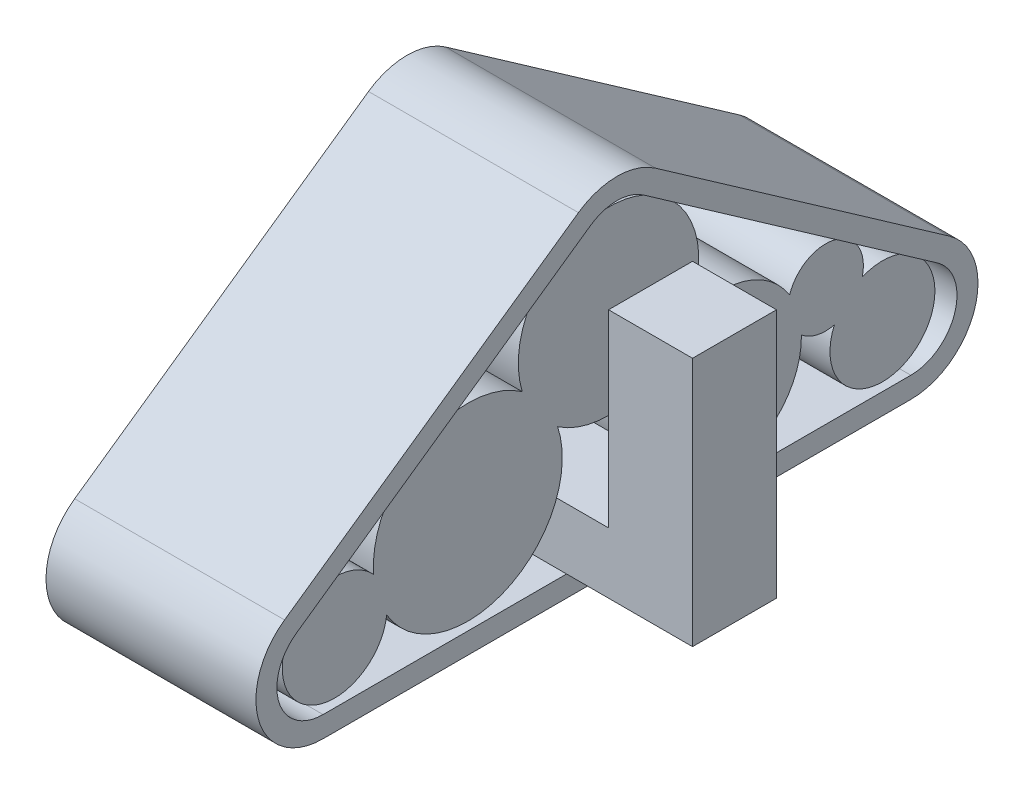
ISO-10303-21;
HEADER;
FILE_DESCRIPTION(('STEP AP214'),'2;1');
FILE_NAME('part.step','',(''),(''),'','','');
FILE_SCHEMA(('AUTOMOTIVE_DESIGN { 1 0 10303 214 1 1 1 1 }'));
ENDSEC;
DATA;
#1=APPLICATION_CONTEXT('core data for automotive mechanical design processes');
#2=APPLICATION_PROTOCOL_DEFINITION('international standard','automotive_design',2000,#1);
#3=PRODUCT_CONTEXT('',#1,'mechanical');
#4=PRODUCT('Part','Part','',(#3));
#5=PRODUCT_RELATED_PRODUCT_CATEGORY('part','',(#4));
#6=PRODUCT_DEFINITION_FORMATION('','',#4);
#7=PRODUCT_DEFINITION_CONTEXT('part definition',#1,'design');
#8=PRODUCT_DEFINITION('design','',#6,#7);
#9=PRODUCT_DEFINITION_SHAPE('','',#8);
#10=(LENGTH_UNIT() NAMED_UNIT(*) SI_UNIT(.MILLI.,.METRE.));
#11=(NAMED_UNIT(*) PLANE_ANGLE_UNIT() SI_UNIT($,.RADIAN.));
#12=(NAMED_UNIT(*) SI_UNIT($,.STERADIAN.) SOLID_ANGLE_UNIT());
#13=UNCERTAINTY_MEASURE_WITH_UNIT(LENGTH_MEASURE(1.E-05),#10,'distance_accuracy_value','');
#14=(GEOMETRIC_REPRESENTATION_CONTEXT(3) GLOBAL_UNCERTAINTY_ASSIGNED_CONTEXT((#13)) GLOBAL_UNIT_ASSIGNED_CONTEXT((#10,
#11,#12)) REPRESENTATION_CONTEXT('',''));
#15=CARTESIAN_POINT('',(0.,0.,0.));
#16=DIRECTION('',(0.,0.,1.));
#17=DIRECTION('',(1.,0.,0.));
#18=AXIS2_PLACEMENT_3D('',#15,#16,#17);
#19=CARTESIAN_POINT('',(0.1,0.,0.));
#20=DIRECTION('',(1.,0.,0.));
#21=DIRECTION('',(0.,0.,-1.));
#22=AXIS2_PLACEMENT_3D('',#19,#20,#21);
#23=PLANE('',#22);
#24=CARTESIAN_POINT('',(0.1,2.6098197246342,0.));
#25=DIRECTION('',(1.,0.,0.));
#26=DIRECTION('',(0.,0.,-1.));
#27=AXIS2_PLACEMENT_3D('',#24,#25,#26);
#28=CIRCLE('',#27,1.075);
#29=CARTESIAN_POINT('',(0.1,1.72204305705104,0.606199297669457));
#30=VERTEX_POINT('',#29);
#31=CARTESIAN_POINT('',(0.1,1.66976450324786,-0.521460622429232));
#32=VERTEX_POINT('',#31);
#33=EDGE_CURVE('E666',#30,#32,#28,.T.);
#34=ORIENTED_EDGE('',*,*,#33,.F.);
#35=CARTESIAN_POINT('',(0.1,1.375,1.67633298864114));
#36=DIRECTION('',(1.,0.,0.));
#37=DIRECTION('',(0.,0.,-1.));
#38=AXIS2_PLACEMENT_3D('',#35,#36,#37);
#39=CIRCLE('',#38,1.125);
#40=CARTESIAN_POINT('',(0.1,0.797718656971334,2.64192671842143));
#41=VERTEX_POINT('',#40);
#42=EDGE_CURVE('E692',#41,#30,#39,.T.);
#43=ORIENTED_EDGE('',*,*,#42,.F.);
#44=CARTESIAN_POINT('',(0.1,0.875000000000002,3.26213038982276));
#45=DIRECTION('',(1.,0.,0.));
#46=DIRECTION('',(0.,0.,-1.));
#47=AXIS2_PLACEMENT_3D('',#44,#45,#46);
#48=CIRCLE('',#47,0.625);
#49=CARTESIAN_POINT('',(0.1,1.29403938178154,2.79841604184963));
#50=VERTEX_POINT('',#49);
#51=EDGE_CURVE('E589',#50,#41,#48,.T.);
#52=ORIENTED_EDGE('',*,*,#51,.F.);
#53=CARTESIAN_POINT('',(0.1,2.29411096497886,1.02759572745165));
#54=VERTEX_POINT('',#53);
#55=EDGE_CURVE('E694',#54,#50,#39,.T.);
#56=ORIENTED_EDGE('',*,*,#55,.F.);
#57=CARTESIAN_POINT('',(0.1,2.04620627521986,-0.915404216529112));
#58=VERTEX_POINT('',#57);
#59=EDGE_CURVE('E737',#58,#54,#28,.T.);
#60=ORIENTED_EDGE('',*,*,#59,.F.);
#61=CARTESIAN_POINT('',(0.1,1.2,-1.34718534138119));
#62=DIRECTION('',(1.,0.,0.));
#63=DIRECTION('',(0.,0.,-1.));
#64=AXIS2_PLACEMENT_3D('',#61,#62,#63);
#65=CIRCLE('',#64,0.950000000000001);
#66=CARTESIAN_POINT('',(0.1,1.69821343428876,-2.15606318994314));
#67=VERTEX_POINT('',#66);
#68=EDGE_CURVE('E727',#67,#58,#65,.T.);
#69=ORIENTED_EDGE('',*,*,#68,.F.);
#70=CARTESIAN_POINT('',(0.1,1.56265537250669,-2.5851599294855));
#71=DIRECTION('',(1.,0.,0.));
#72=DIRECTION('',(0.,0.,-1.));
#73=AXIS2_PLACEMENT_3D('',#70,#71,#72);
#74=CIRCLE('',#73,0.45);
#75=CARTESIAN_POINT('',(0.1,1.45172587783847,-3.02127304235033));
#76=VERTEX_POINT('',#75);
#77=EDGE_CURVE('E732',#76,#67,#74,.T.);
#78=ORIENTED_EDGE('',*,*,#77,.F.);
#79=CARTESIAN_POINT('',(0.1,0.875000000000002,-3.26213038982276));
#80=DIRECTION('',(1.,0.,0.));
#81=DIRECTION('',(0.,0.,-1.));
#82=AXIS2_PLACEMENT_3D('',#79,#80,#81);
#83=CIRCLE('',#82,0.625);
#84=CARTESIAN_POINT('',(0.1,1.124858698694,-2.68924677975266));
#85=VERTEX_POINT('',#84);
#86=EDGE_CURVE('E731',#76,#85,#83,.F.);
#87=ORIENTED_EDGE('',*,*,#86,.T.);
#88=CARTESIAN_POINT('',(0.1,1.2169921219537,-2.2970333649047));
#89=VERTEX_POINT('',#88);
#90=EDGE_CURVE('E726',#89,#85,#74,.T.);
#91=ORIENTED_EDGE('',*,*,#90,.F.);
#92=EDGE_CURVE('E723',#32,#89,#65,.T.);
#93=ORIENTED_EDGE('',*,*,#92,.F.);
#94=EDGE_LOOP('',(#34,#43,#52,#56,#60,#69,#78,#87,#91,#93));
#95=FACE_BOUND('',#94,.T.);
#96=ADVANCED_FACE('F570',(#95),#23,.F.);
#97=CARTESIAN_POINT('',(2.4,2.6098197246342,0.));
#98=DIRECTION('',(-1.,0.,0.));
#99=DIRECTION('',(0.,0.,1.));
#100=AXIS2_PLACEMENT_3D('',#97,#98,#99);
#101=CYLINDRICAL_SURFACE('',#100,1.075);
#102=DIRECTION('',(-1.,0.,0.));
#103=VECTOR('',#102,1.);
#104=CARTESIAN_POINT('',(2.4,1.72204305705104,0.606199297669457));
#105=LINE('',#104,#103);
#106=CARTESIAN_POINT('',(2.4,1.72204305705104,0.606199297669456));
#107=VERTEX_POINT('',#106);
#108=EDGE_CURVE('E703',#107,#30,#105,.T.);
#109=ORIENTED_EDGE('',*,*,#108,.T.);
#110=ORIENTED_EDGE('',*,*,#33,.T.);
#111=DIRECTION('',(-1.,0.,0.));
#112=VECTOR('',#111,1.);
#113=CARTESIAN_POINT('',(2.4,1.66976450324786,-0.521460622429232));
#114=LINE('',#113,#112);
#115=CARTESIAN_POINT('',(2.4,1.66976450324786,-0.521460622429232));
#116=VERTEX_POINT('',#115);
#117=EDGE_CURVE('E659',#116,#32,#114,.T.);
#118=ORIENTED_EDGE('',*,*,#117,.F.);
#119=CARTESIAN_POINT('',(2.4,2.6098197246342,0.));
#120=DIRECTION('',(1.,0.,0.));
#121=DIRECTION('',(0.,0.,-1.));
#122=AXIS2_PLACEMENT_3D('',#119,#120,#121);
#123=CIRCLE('',#122,1.075);
#124=EDGE_CURVE('E663',#107,#116,#123,.T.);
#125=ORIENTED_EDGE('',*,*,#124,.F.);
#126=EDGE_LOOP('',(#109,#110,#118,#125));
#127=FACE_BOUND('',#126,.T.);
#128=ADVANCED_FACE('F661',(#127),#101,.T.);
#129=CARTESIAN_POINT('',(2.4,0.,0.));
#130=DIRECTION('',(1.,0.,0.));
#131=DIRECTION('',(0.,0.,-1.));
#132=AXIS2_PLACEMENT_3D('',#129,#130,#131);
#133=PLANE('',#132);
#134=CARTESIAN_POINT('',(2.4,2.04620627521986,-0.915404216529112));
#135=VERTEX_POINT('',#134);
#136=CARTESIAN_POINT('',(2.4,2.29411096497886,1.02759572745165));
#137=VERTEX_POINT('',#136);
#138=EDGE_CURVE('E688',#135,#137,#123,.T.);
#139=ORIENTED_EDGE('',*,*,#138,.T.);
#140=CARTESIAN_POINT('',(2.4,1.375,1.67633298864114));
#141=DIRECTION('',(1.,0.,0.));
#142=DIRECTION('',(0.,0.,-1.));
#143=AXIS2_PLACEMENT_3D('',#140,#141,#142);
#144=CIRCLE('',#143,1.125);
#145=CARTESIAN_POINT('',(2.4,1.29403938178154,2.79841604184963));
#146=VERTEX_POINT('',#145);
#147=EDGE_CURVE('E699',#137,#146,#144,.T.);
#148=ORIENTED_EDGE('',*,*,#147,.T.);
#149=CARTESIAN_POINT('',(2.4,0.875000000000002,3.26213038982276));
#150=DIRECTION('',(1.,0.,0.));
#151=DIRECTION('',(0.,0.,-1.));
#152=AXIS2_PLACEMENT_3D('',#149,#150,#151);
#153=CIRCLE('',#152,0.625);
#154=CARTESIAN_POINT('',(2.4,0.797718656971334,2.64192671842143));
#155=VERTEX_POINT('',#154);
#156=EDGE_CURVE('E709',#146,#155,#153,.T.);
#157=ORIENTED_EDGE('',*,*,#156,.T.);
#158=EDGE_CURVE('E686',#155,#107,#144,.T.);
#159=ORIENTED_EDGE('',*,*,#158,.T.);
#160=ORIENTED_EDGE('',*,*,#124,.T.);
#161=CARTESIAN_POINT('',(2.4,1.2,-1.34718534138119));
#162=DIRECTION('',(1.,0.,0.));
#163=DIRECTION('',(0.,0.,-1.));
#164=AXIS2_PLACEMENT_3D('',#161,#162,#163);
#165=CIRCLE('',#164,0.950000000000001);
#166=CARTESIAN_POINT('',(2.4,1.2169921219537,-2.2970333649047));
#167=VERTEX_POINT('',#166);
#168=EDGE_CURVE('E673',#116,#167,#165,.T.);
#169=ORIENTED_EDGE('',*,*,#168,.T.);
#170=CARTESIAN_POINT('',(2.4,1.56265537250669,-2.5851599294855));
#171=DIRECTION('',(1.,0.,0.));
#172=DIRECTION('',(0.,0.,-1.));
#173=AXIS2_PLACEMENT_3D('',#170,#171,#172);
#174=CIRCLE('',#173,0.45);
#175=CARTESIAN_POINT('',(2.4,1.124858698694,-2.68924677975266));
#176=VERTEX_POINT('',#175);
#177=EDGE_CURVE('E679',#167,#176,#174,.T.);
#178=ORIENTED_EDGE('',*,*,#177,.T.);
#179=CARTESIAN_POINT('',(2.4,0.875000000000002,-3.26213038982276));
#180=DIRECTION('',(1.,0.,0.));
#181=DIRECTION('',(0.,0.,-1.));
#182=AXIS2_PLACEMENT_3D('',#179,#180,#181);
#183=CIRCLE('',#182,0.625);
#184=CARTESIAN_POINT('',(2.4,1.45172587783847,-3.02127304235033));
#185=VERTEX_POINT('',#184);
#186=EDGE_CURVE('E718',#185,#176,#183,.F.);
#187=ORIENTED_EDGE('',*,*,#186,.F.);
#188=CARTESIAN_POINT('',(2.4,1.69821343428876,-2.15606318994314));
#189=VERTEX_POINT('',#188);
#190=EDGE_CURVE('E719',#185,#189,#174,.T.);
#191=ORIENTED_EDGE('',*,*,#190,.T.);
#192=EDGE_CURVE('E681',#189,#135,#165,.T.);
#193=ORIENTED_EDGE('',*,*,#192,.T.);
#194=EDGE_LOOP('',(#139,#148,#157,#159,#160,#169,#178,#187,#191,#193));
#195=FACE_BOUND('',#194,.T.);
#196=ADVANCED_FACE('F683',(#195),#133,.T.);
#197=DIRECTION('',(-1.,0.,0.));
#198=VECTOR('',#197,1.);
#199=CARTESIAN_POINT('',(2.4,2.04620627521986,-0.915404216529112));
#200=LINE('',#199,#198);
#201=EDGE_CURVE('E633',#135,#58,#200,.T.);
#202=ORIENTED_EDGE('',*,*,#201,.T.);
#203=ORIENTED_EDGE('',*,*,#59,.T.);
#204=DIRECTION('',(-1.,0.,0.));
#205=VECTOR('',#204,1.);
#206=CARTESIAN_POINT('',(2.4,2.29411096497886,1.02759572745165));
#207=LINE('',#206,#205);
#208=EDGE_CURVE('E706',#137,#54,#207,.T.);
#209=ORIENTED_EDGE('',*,*,#208,.F.);
#210=ORIENTED_EDGE('',*,*,#138,.F.);
#211=EDGE_LOOP('',(#202,#203,#209,#210));
#212=FACE_BOUND('',#211,.T.);
#213=ADVANCED_FACE('F780',(#212),#101,.T.);
#214=CARTESIAN_POINT('',(0.1,0.875000000000002,-3.26213038982276));
#215=DIRECTION('',(1.,0.,0.));
#216=DIRECTION('',(0.,0.,-1.));
#217=AXIS2_PLACEMENT_3D('',#214,#215,#216);
#218=CYLINDRICAL_SURFACE('',#217,0.625);
#219=DIRECTION('',(1.,0.,0.));
#220=VECTOR('',#219,1.);
#221=CARTESIAN_POINT('',(0.1,1.45172587783847,-3.02127304235033));
#222=LINE('',#221,#220);
#223=EDGE_CURVE('E617',#76,#185,#222,.T.);
#224=ORIENTED_EDGE('',*,*,#223,.T.);
#225=ORIENTED_EDGE('',*,*,#186,.T.);
#226=DIRECTION('',(1.,0.,0.));
#227=VECTOR('',#226,1.);
#228=CARTESIAN_POINT('',(0.1,1.124858698694,-2.68924677975266));
#229=LINE('',#228,#227);
#230=EDGE_CURVE('E739',#85,#176,#229,.T.);
#231=ORIENTED_EDGE('',*,*,#230,.F.);
#232=ORIENTED_EDGE('',*,*,#86,.F.);
#233=EDGE_LOOP('',(#224,#225,#231,#232));
#234=FACE_BOUND('',#233,.T.);
#235=ADVANCED_FACE('F572',(#234),#218,.T.);
#236=CARTESIAN_POINT('',(0.1,1.56265537250669,-2.5851599294855));
#237=DIRECTION('',(1.,0.,0.));
#238=DIRECTION('',(0.,0.,-1.));
#239=AXIS2_PLACEMENT_3D('',#236,#237,#238);
#240=CYLINDRICAL_SURFACE('',#239,0.45);
#241=DIRECTION('',(1.,0.,0.));
#242=VECTOR('',#241,1.);
#243=CARTESIAN_POINT('',(0.1,1.69821343428876,-2.15606318994314));
#244=LINE('',#243,#242);
#245=EDGE_CURVE('E624',#67,#189,#244,.T.);
#246=ORIENTED_EDGE('',*,*,#245,.T.);
#247=ORIENTED_EDGE('',*,*,#190,.F.);
#248=ORIENTED_EDGE('',*,*,#223,.F.);
#249=ORIENTED_EDGE('',*,*,#77,.T.);
#250=EDGE_LOOP('',(#246,#247,#248,#249));
#251=FACE_BOUND('',#250,.T.);
#252=ADVANCED_FACE('F752',(#251),#240,.T.);
#253=ORIENTED_EDGE('',*,*,#230,.T.);
#254=ORIENTED_EDGE('',*,*,#177,.F.);
#255=DIRECTION('',(1.,0.,0.));
#256=VECTOR('',#255,1.);
#257=CARTESIAN_POINT('',(0.1,1.2169921219537,-2.2970333649047));
#258=LINE('',#257,#256);
#259=EDGE_CURVE('E574',#89,#167,#258,.T.);
#260=ORIENTED_EDGE('',*,*,#259,.F.);
#261=ORIENTED_EDGE('',*,*,#90,.T.);
#262=EDGE_LOOP('',(#253,#254,#260,#261));
#263=FACE_BOUND('',#262,.T.);
#264=ADVANCED_FACE('F771',(#263),#240,.T.);
#265=CARTESIAN_POINT('',(0.1,1.2,-1.34718534138119));
#266=DIRECTION('',(1.,0.,0.));
#267=DIRECTION('',(0.,0.,-1.));
#268=AXIS2_PLACEMENT_3D('',#265,#266,#267);
#269=CYLINDRICAL_SURFACE('',#268,0.950000000000001);
#270=ORIENTED_EDGE('',*,*,#259,.T.);
#271=ORIENTED_EDGE('',*,*,#168,.F.);
#272=ORIENTED_EDGE('',*,*,#117,.T.);
#273=ORIENTED_EDGE('',*,*,#92,.T.);
#274=EDGE_LOOP('',(#270,#271,#272,#273));
#275=FACE_BOUND('',#274,.T.);
#276=ADVANCED_FACE('F674',(#275),#269,.T.);
#277=ORIENTED_EDGE('',*,*,#201,.F.);
#278=ORIENTED_EDGE('',*,*,#192,.F.);
#279=ORIENTED_EDGE('',*,*,#245,.F.);
#280=ORIENTED_EDGE('',*,*,#68,.T.);
#281=EDGE_LOOP('',(#277,#278,#279,#280));
#282=FACE_BOUND('',#281,.T.);
#283=ADVANCED_FACE('F796',(#282),#269,.T.);
#284=CARTESIAN_POINT('',(0.1,0.875000000000002,3.26213038982276));
#285=DIRECTION('',(1.,0.,0.));
#286=DIRECTION('',(0.,0.,-1.));
#287=AXIS2_PLACEMENT_3D('',#284,#285,#286);
#288=CYLINDRICAL_SURFACE('',#287,0.625);
#289=DIRECTION('',(1.,0.,0.));
#290=VECTOR('',#289,1.);
#291=CARTESIAN_POINT('',(0.1,0.797718656971334,2.64192671842143));
#292=LINE('',#291,#290);
#293=EDGE_CURVE('E13',#41,#155,#292,.T.);
#294=ORIENTED_EDGE('',*,*,#293,.T.);
#295=ORIENTED_EDGE('',*,*,#156,.F.);
#296=DIRECTION('',(1.,0.,0.));
#297=VECTOR('',#296,1.);
#298=CARTESIAN_POINT('',(0.1,1.29403938178154,2.79841604184963));
#299=LINE('',#298,#297);
#300=EDGE_CURVE('E581',#50,#146,#299,.T.);
#301=ORIENTED_EDGE('',*,*,#300,.F.);
#302=ORIENTED_EDGE('',*,*,#51,.T.);
#303=EDGE_LOOP('',(#294,#295,#301,#302));
#304=FACE_BOUND('',#303,.T.);
#305=ADVANCED_FACE('F783',(#304),#288,.T.);
#306=CARTESIAN_POINT('',(2.4,1.375,1.67633298864114));
#307=DIRECTION('',(-1.,0.,0.));
#308=DIRECTION('',(0.,0.,1.));
#309=AXIS2_PLACEMENT_3D('',#306,#307,#308);
#310=CYLINDRICAL_SURFACE('',#309,1.125);
#311=ORIENTED_EDGE('',*,*,#208,.T.);
#312=ORIENTED_EDGE('',*,*,#55,.T.);
#313=ORIENTED_EDGE('',*,*,#300,.T.);
#314=ORIENTED_EDGE('',*,*,#147,.F.);
#315=EDGE_LOOP('',(#311,#312,#313,#314));
#316=FACE_BOUND('',#315,.T.);
#317=ADVANCED_FACE('F781',(#316),#310,.T.);
#318=ORIENTED_EDGE('',*,*,#158,.F.);
#319=ORIENTED_EDGE('',*,*,#293,.F.);
#320=ORIENTED_EDGE('',*,*,#42,.T.);
#321=ORIENTED_EDGE('',*,*,#108,.F.);
#322=EDGE_LOOP('',(#318,#319,#320,#321));
#323=FACE_BOUND('',#322,.T.);
#324=ADVANCED_FACE('F770',(#323),#310,.T.);
#325=CLOSED_SHELL('',(#96,#128,#196,#213,#235,#252,#264,#276,#283,#305,#317,#324));
#326=MANIFOLD_SOLID_BREP('B2',#325);
#327=CARTESIAN_POINT('',(0.,0.975000000000002,0.));
#328=DIRECTION('',(0.,1.,0.));
#329=DIRECTION('',(0.,0.,1.));
#330=AXIS2_PLACEMENT_3D('',#327,#328,#329);
#331=PLANE('',#330);
#332=DIRECTION('',(1.,0.,0.));
#333=VECTOR('',#332,1.);
#334=CARTESIAN_POINT('',(0.,0.975000000000002,0.6));
#335=LINE('',#334,#333);
#336=CARTESIAN_POINT('',(0.,0.975000000000002,0.6));
#337=VERTEX_POINT('',#336);
#338=CARTESIAN_POINT('',(3.,0.975000000000002,0.6));
#339=VERTEX_POINT('',#338);
#340=EDGE_CURVE('E1191',#337,#339,#335,.T.);
#341=ORIENTED_EDGE('',*,*,#340,.T.);
#342=DIRECTION('',(0.,0.,1.));
#343=VECTOR('',#342,1.);
#344=CARTESIAN_POINT('',(3.,0.975000000000002,-0.4));
#345=LINE('',#344,#343);
#346=CARTESIAN_POINT('',(3.,0.975000000000002,-0.4));
#347=VERTEX_POINT('',#346);
#348=EDGE_CURVE('E1150',#347,#339,#345,.T.);
#349=ORIENTED_EDGE('',*,*,#348,.F.);
#350=DIRECTION('',(1.,0.,0.));
#351=VECTOR('',#350,1.);
#352=CARTESIAN_POINT('',(0.,0.975000000000002,-0.4));
#353=LINE('',#352,#351);
#354=CARTESIAN_POINT('',(0.,0.975000000000002,-0.4));
#355=VERTEX_POINT('',#354);
#356=EDGE_CURVE('E1181',#355,#347,#353,.T.);
#357=ORIENTED_EDGE('',*,*,#356,.F.);
#358=DIRECTION('',(0.,0.,1.));
#359=VECTOR('',#358,1.);
#360=CARTESIAN_POINT('',(0.,0.975000000000002,0.));
#361=LINE('',#360,#359);
#362=EDGE_CURVE('E1174',#355,#337,#361,.T.);
#363=ORIENTED_EDGE('',*,*,#362,.T.);
#364=EDGE_LOOP('',(#341,#349,#357,#363));
#365=FACE_BOUND('',#364,.T.);
#366=ADVANCED_FACE('F987',(#365),#331,.T.);
#367=CARTESIAN_POINT('',(2.5,0.250000000000001,0.));
#368=DIRECTION('',(0.,-1.,0.));
#369=DIRECTION('',(0.,0.,-1.));
#370=AXIS2_PLACEMENT_3D('',#367,#368,#369);
#371=PLANE('',#370);
#372=DIRECTION('',(1.,0.,0.));
#373=VECTOR('',#372,1.);
#374=CARTESIAN_POINT('',(0.,0.250000000000002,0.6));
#375=LINE('',#374,#373);
#376=CARTESIAN_POINT('',(0.,0.250000000000002,0.6));
#377=VERTEX_POINT('',#376);
#378=CARTESIAN_POINT('',(2.5,0.250000000000001,0.6));
#379=VERTEX_POINT('',#378);
#380=EDGE_CURVE('E1186',#377,#379,#375,.T.);
#381=ORIENTED_EDGE('',*,*,#380,.F.);
#382=DIRECTION('',(0.,0.,1.));
#383=VECTOR('',#382,1.);
#384=CARTESIAN_POINT('',(0.,0.250000000000001,0.));
#385=LINE('',#384,#383);
#386=CARTESIAN_POINT('',(0.,0.250000000000001,3.5));
#387=VERTEX_POINT('',#386);
#388=EDGE_CURVE('E1235',#377,#387,#385,.T.);
#389=ORIENTED_EDGE('',*,*,#388,.T.);
#390=DIRECTION('',(-1.,0.,0.));
#391=VECTOR('',#390,1.);
#392=CARTESIAN_POINT('',(2.5,0.250000000000001,3.5));
#393=LINE('',#392,#391);
#394=CARTESIAN_POINT('',(2.5,0.250000000000001,3.5));
#395=VERTEX_POINT('',#394);
#396=EDGE_CURVE('E1248',#395,#387,#393,.T.);
#397=ORIENTED_EDGE('',*,*,#396,.F.);
#398=DIRECTION('',(0.,0.,1.));
#399=VECTOR('',#398,1.);
#400=CARTESIAN_POINT('',(2.5,0.250000000000001,0.));
#401=LINE('',#400,#399);
#402=EDGE_CURVE('E1005',#379,#395,#401,.T.);
#403=ORIENTED_EDGE('',*,*,#402,.F.);
#404=EDGE_LOOP('',(#381,#389,#397,#403));
#405=FACE_BOUND('',#404,.T.);
#406=ADVANCED_FACE('F1357',(#405),#371,.F.);
#407=CARTESIAN_POINT('',(2.5,0.800000000000001,3.5));
#408=DIRECTION('',(-1.,0.,0.));
#409=DIRECTION('',(0.,0.,1.));
#410=AXIS2_PLACEMENT_3D('',#407,#408,#409);
#411=CYLINDRICAL_SURFACE('',#410,0.8);
#412=CARTESIAN_POINT('',(0.,0.800000000000001,3.5));
#413=DIRECTION('',(-1.,0.,0.));
#414=DIRECTION('',(0.,0.,1.));
#415=AXIS2_PLACEMENT_3D('',#412,#413,#414);
#416=CIRCLE('',#415,0.8);
#417=CARTESIAN_POINT('',(0.,0.,3.5));
#418=VERTEX_POINT('',#417);
#419=CARTESIAN_POINT('',(0.,1.4553216354312,3.95886114908083));
#420=VERTEX_POINT('',#419);
#421=EDGE_CURVE('E1261',#418,#420,#416,.T.);
#422=ORIENTED_EDGE('',*,*,#421,.F.);
#423=DIRECTION('',(-1.,0.,0.));
#424=VECTOR('',#423,1.);
#425=CARTESIAN_POINT('',(2.5,0.,3.5));
#426=LINE('',#425,#424);
#427=CARTESIAN_POINT('',(2.5,0.,3.5));
#428=VERTEX_POINT('',#427);
#429=EDGE_CURVE('E568',#428,#418,#426,.T.);
#430=ORIENTED_EDGE('',*,*,#429,.F.);
#431=CARTESIAN_POINT('',(2.5,0.800000000000001,3.5));
#432=DIRECTION('',(-1.,0.,0.));
#433=DIRECTION('',(0.,0.,1.));
#434=AXIS2_PLACEMENT_3D('',#431,#432,#433);
#435=CIRCLE('',#434,0.8);
#436=CARTESIAN_POINT('',(2.5,1.4553216354312,3.95886114908083));
#437=VERTEX_POINT('',#436);
#438=EDGE_CURVE('E1262',#428,#437,#435,.T.);
#439=ORIENTED_EDGE('',*,*,#438,.T.);
#440=DIRECTION('',(-1.,0.,0.));
#441=VECTOR('',#440,1.);
#442=CARTESIAN_POINT('',(2.5,1.4553216354312,3.95886114908083));
#443=LINE('',#442,#441);
#444=EDGE_CURVE('E991',#437,#420,#443,.T.);
#445=ORIENTED_EDGE('',*,*,#444,.T.);
#446=EDGE_LOOP('',(#422,#430,#439,#445));
#447=FACE_BOUND('',#446,.T.);
#448=ADVANCED_FACE('F989',(#447),#411,.T.);
#449=CARTESIAN_POINT('',(2.5,0.,3.));
#450=DIRECTION('',(0.,-1.,0.));
#451=DIRECTION('',(0.,0.,-1.));
#452=AXIS2_PLACEMENT_3D('',#449,#450,#451);
#453=PLANE('',#452);
#454=DIRECTION('',(0.,0.,1.));
#455=VECTOR('',#454,1.);
#456=CARTESIAN_POINT('',(0.,0.,3.));
#457=LINE('',#456,#455);
#458=CARTESIAN_POINT('',(0.,0.,-3.5));
#459=VERTEX_POINT('',#458);
#460=EDGE_CURVE('E1267',#459,#418,#457,.T.);
#461=ORIENTED_EDGE('',*,*,#460,.F.);
#462=DIRECTION('',(-1.,0.,0.));
#463=VECTOR('',#462,1.);
#464=CARTESIAN_POINT('',(2.5,0.,-3.5));
#465=LINE('',#464,#463);
#466=CARTESIAN_POINT('',(2.5,0.,-3.5));
#467=VERTEX_POINT('',#466);
#468=EDGE_CURVE('E997',#467,#459,#465,.T.);
#469=ORIENTED_EDGE('',*,*,#468,.F.);
#470=DIRECTION('',(0.,0.,-1.));
#471=VECTOR('',#470,1.);
#472=CARTESIAN_POINT('',(2.5,0.,-3.));
#473=LINE('',#472,#471);
#474=EDGE_CURVE('E1282',#428,#467,#473,.T.);
#475=ORIENTED_EDGE('',*,*,#474,.F.);
#476=ORIENTED_EDGE('',*,*,#429,.T.);
#477=EDGE_LOOP('',(#461,#469,#475,#476));
#478=FACE_BOUND('',#477,.T.);
#479=ADVANCED_FACE('F1335',(#478),#453,.T.);
#480=CARTESIAN_POINT('',(2.5,0.800000000000002,-3.5));
#481=DIRECTION('',(-1.,0.,0.));
#482=DIRECTION('',(0.,0.,1.));
#483=AXIS2_PLACEMENT_3D('',#480,#481,#482);
#484=CYLINDRICAL_SURFACE('',#483,0.8);
#485=CARTESIAN_POINT('',(0.,0.800000000000002,-3.5));
#486=DIRECTION('',(-1.,0.,0.));
#487=DIRECTION('',(0.,0.,1.));
#488=AXIS2_PLACEMENT_3D('',#485,#486,#487);
#489=CIRCLE('',#488,0.8);
#490=CARTESIAN_POINT('',(0.,1.4553216354312,-3.95886114908083));
#491=VERTEX_POINT('',#490);
#492=EDGE_CURVE('E1300',#491,#459,#489,.T.);
#493=ORIENTED_EDGE('',*,*,#492,.F.);
#494=DIRECTION('',(-1.,0.,0.));
#495=VECTOR('',#494,1.);
#496=CARTESIAN_POINT('',(2.5,1.4553216354312,-3.95886114908083));
#497=LINE('',#496,#495);
#498=CARTESIAN_POINT('',(2.5,1.4553216354312,-3.95886114908083));
#499=VERTEX_POINT('',#498);
#500=EDGE_CURVE('E1310',#499,#491,#497,.T.);
#501=ORIENTED_EDGE('',*,*,#500,.F.);
#502=CARTESIAN_POINT('',(2.5,0.800000000000002,-3.5));
#503=DIRECTION('',(-1.,0.,0.));
#504=DIRECTION('',(0.,0.,1.));
#505=AXIS2_PLACEMENT_3D('',#502,#503,#504);
#506=CIRCLE('',#505,0.8);
#507=EDGE_CURVE('E1278',#499,#467,#506,.T.);
#508=ORIENTED_EDGE('',*,*,#507,.T.);
#509=ORIENTED_EDGE('',*,*,#468,.T.);
#510=EDGE_LOOP('',(#493,#501,#508,#509));
#511=FACE_BOUND('',#510,.T.);
#512=ADVANCED_FACE('F1337',(#511),#484,.T.);
#513=CARTESIAN_POINT('',(2.5,1.4553216354312,-3.95886114908083));
#514=DIRECTION('',(0.,-0.819152044288995,0.573576436351042));
#515=DIRECTION('',(0.,-0.573576436351042,-0.819152044288995));
#516=AXIS2_PLACEMENT_3D('',#513,#514,#515);
#517=PLANE('',#516);
#518=DIRECTION('',(0.,0.573576436351042,0.819152044288995));
#519=VECTOR('',#518,1.);
#520=CARTESIAN_POINT('',(0.,1.4553216354312,-3.95886114908083));
#521=LINE('',#520,#519);
#522=CARTESIAN_POINT('',(0.,3.90604801916515,-0.458861149080833));
#523=VERTEX_POINT('',#522);
#524=EDGE_CURVE('E1296',#491,#523,#521,.T.);
#525=ORIENTED_EDGE('',*,*,#524,.T.);
#526=DIRECTION('',(-1.,0.,0.));
#527=VECTOR('',#526,1.);
#528=CARTESIAN_POINT('',(2.5,3.90604801916515,-0.458861149080833));
#529=LINE('',#528,#527);
#530=CARTESIAN_POINT('',(2.5,3.90604801916515,-0.458861149080833));
#531=VERTEX_POINT('',#530);
#532=EDGE_CURVE('E1313',#531,#523,#529,.T.);
#533=ORIENTED_EDGE('',*,*,#532,.F.);
#534=DIRECTION('',(0.,0.573576436351042,0.819152044288995));
#535=VECTOR('',#534,1.);
#536=CARTESIAN_POINT('',(2.5,1.4553216354312,-3.95886114908083));
#537=LINE('',#536,#535);
#538=EDGE_CURVE('E1275',#499,#531,#537,.T.);
#539=ORIENTED_EDGE('',*,*,#538,.F.);
#540=ORIENTED_EDGE('',*,*,#500,.T.);
#541=EDGE_LOOP('',(#525,#533,#539,#540));
#542=FACE_BOUND('',#541,.T.);
#543=ADVANCED_FACE('F1347',(#542),#517,.F.);
#544=CARTESIAN_POINT('',(2.5,3.25072638373396,0.));
#545=DIRECTION('',(-1.,0.,0.));
#546=DIRECTION('',(0.,0.,1.));
#547=AXIS2_PLACEMENT_3D('',#544,#545,#546);
#548=CYLINDRICAL_SURFACE('',#547,0.799999999999999);
#549=CARTESIAN_POINT('',(0.,3.25072638373396,0.));
#550=DIRECTION('',(-1.,0.,0.));
#551=DIRECTION('',(0.,0.,1.));
#552=AXIS2_PLACEMENT_3D('',#549,#550,#551);
#553=CIRCLE('',#552,0.799999999999999);
#554=CARTESIAN_POINT('',(0.,3.90604801916515,0.458861149080833));
#555=VERTEX_POINT('',#554);
#556=EDGE_CURVE('E1292',#555,#523,#553,.T.);
#557=ORIENTED_EDGE('',*,*,#556,.F.);
#558=DIRECTION('',(-1.,0.,0.));
#559=VECTOR('',#558,1.);
#560=CARTESIAN_POINT('',(2.5,3.90604801916515,0.458861149080833));
#561=LINE('',#560,#559);
#562=CARTESIAN_POINT('',(2.5,3.90604801916515,0.458861149080833));
#563=VERTEX_POINT('',#562);
#564=EDGE_CURVE('E1315',#563,#555,#561,.T.);
#565=ORIENTED_EDGE('',*,*,#564,.F.);
#566=CARTESIAN_POINT('',(2.5,3.25072638373396,0.));
#567=DIRECTION('',(-1.,0.,0.));
#568=DIRECTION('',(0.,0.,1.));
#569=AXIS2_PLACEMENT_3D('',#566,#567,#568);
#570=CIRCLE('',#569,0.799999999999999);
#571=EDGE_CURVE('E1271',#563,#531,#570,.T.);
#572=ORIENTED_EDGE('',*,*,#571,.T.);
#573=ORIENTED_EDGE('',*,*,#532,.T.);
#574=EDGE_LOOP('',(#557,#565,#572,#573));
#575=FACE_BOUND('',#574,.T.);
#576=ADVANCED_FACE('F1345',(#575),#548,.T.);
#577=CARTESIAN_POINT('',(2.5,1.4553216354312,3.95886114908083));
#578=DIRECTION('',(0.,0.819152044288995,0.573576436351042));
#579=DIRECTION('',(0.,-0.573576436351042,0.819152044288995));
#580=AXIS2_PLACEMENT_3D('',#577,#578,#579);
#581=PLANE('',#580);
#582=DIRECTION('',(0.,0.573576436351042,-0.819152044288995));
#583=VECTOR('',#582,1.);
#584=CARTESIAN_POINT('',(0.,1.4553216354312,3.95886114908083));
#585=LINE('',#584,#583);
#586=EDGE_CURVE('E1288',#420,#555,#585,.T.);
#587=ORIENTED_EDGE('',*,*,#586,.F.);
#588=ORIENTED_EDGE('',*,*,#444,.F.);
#589=DIRECTION('',(0.,0.573576436351042,-0.819152044288995));
#590=VECTOR('',#589,1.);
#591=CARTESIAN_POINT('',(2.5,1.4553216354312,3.95886114908083));
#592=LINE('',#591,#590);
#593=EDGE_CURVE('E1266',#437,#563,#592,.T.);
#594=ORIENTED_EDGE('',*,*,#593,.T.);
#595=ORIENTED_EDGE('',*,*,#564,.T.);
#596=EDGE_LOOP('',(#587,#588,#594,#595));
#597=FACE_BOUND('',#596,.T.);
#598=ADVANCED_FACE('F1328',(#597),#581,.T.);
#599=CARTESIAN_POINT('',(2.5,0.800000000000001,3.5));
#600=DIRECTION('',(-1.,0.,0.));
#601=DIRECTION('',(0.,0.,1.));
#602=AXIS2_PLACEMENT_3D('',#599,#600,#601);
#603=PLANE('',#602);
#604=CARTESIAN_POINT('',(2.5,3.25072638373396,0.));
#605=DIRECTION('',(1.,0.,0.));
#606=DIRECTION('',(0.,0.,-1.));
#607=AXIS2_PLACEMENT_3D('',#604,#605,#606);
#608=CIRCLE('',#607,0.55);
#609=CARTESIAN_POINT('',(2.5,3.70126000809291,-0.315467039993072));
#610=VERTEX_POINT('',#609);
#611=CARTESIAN_POINT('',(2.5,3.70126000809291,0.315467039993072));
#612=VERTEX_POINT('',#611);
#613=EDGE_CURVE('E1201',#610,#612,#608,.T.);
#614=ORIENTED_EDGE('',*,*,#613,.F.);
#615=DIRECTION('',(0.,-0.573576436351042,-0.819152044288995));
#616=VECTOR('',#615,1.);
#617=CARTESIAN_POINT('',(2.5,2.63180376806455,-1.8428088374875));
#618=LINE('',#617,#616);
#619=CARTESIAN_POINT('',(2.5,1.25053362435895,-3.81546703999307));
#620=VERTEX_POINT('',#619);
#621=EDGE_CURVE('E1197',#610,#620,#618,.T.);
#622=ORIENTED_EDGE('',*,*,#621,.T.);
#623=CARTESIAN_POINT('',(2.5,0.800000000000002,-3.5));
#624=DIRECTION('',(1.,0.,0.));
#625=DIRECTION('',(0.,0.,-1.));
#626=AXIS2_PLACEMENT_3D('',#623,#624,#625);
#627=CIRCLE('',#626,0.55);
#628=CARTESIAN_POINT('',(2.5,0.250000000000002,-3.5));
#629=VERTEX_POINT('',#628);
#630=EDGE_CURVE('E1215',#620,#629,#627,.F.);
#631=ORIENTED_EDGE('',*,*,#630,.T.);
#632=CARTESIAN_POINT('',(2.5,0.250000000000001,-0.4));
#633=VERTEX_POINT('',#632);
#634=EDGE_CURVE('E1212',#629,#633,#401,.T.);
#635=ORIENTED_EDGE('',*,*,#634,.T.);
#636=EDGE_CURVE('E1216',#633,#379,#401,.T.);
#637=ORIENTED_EDGE('',*,*,#636,.T.);
#638=ORIENTED_EDGE('',*,*,#402,.T.);
#639=CARTESIAN_POINT('',(2.5,0.800000000000001,3.5));
#640=DIRECTION('',(1.,0.,0.));
#641=DIRECTION('',(0.,0.,-1.));
#642=AXIS2_PLACEMENT_3D('',#639,#640,#641);
#643=CIRCLE('',#642,0.55);
#644=CARTESIAN_POINT('',(2.5,1.25053362435895,3.81546703999307));
#645=VERTEX_POINT('',#644);
#646=EDGE_CURVE('E1208',#645,#395,#643,.T.);
#647=ORIENTED_EDGE('',*,*,#646,.F.);
#648=DIRECTION('',(0.,-0.573576436351042,0.819152044288995));
#649=VECTOR('',#648,1.);
#650=CARTESIAN_POINT('',(2.5,2.63180376806455,1.8428088374875));
#651=LINE('',#650,#649);
#652=EDGE_CURVE('E1205',#612,#645,#651,.T.);
#653=ORIENTED_EDGE('',*,*,#652,.F.);
#654=EDGE_LOOP('',(#614,#622,#631,#635,#637,#638,#647,#653));
#655=FACE_BOUND('',#654,.T.);
#656=ORIENTED_EDGE('',*,*,#438,.F.);
#657=ORIENTED_EDGE('',*,*,#474,.T.);
#658=ORIENTED_EDGE('',*,*,#507,.F.);
#659=ORIENTED_EDGE('',*,*,#538,.T.);
#660=ORIENTED_EDGE('',*,*,#571,.F.);
#661=ORIENTED_EDGE('',*,*,#593,.F.);
#662=EDGE_LOOP('',(#656,#657,#658,#659,#660,#661));
#663=FACE_BOUND('',#662,.T.);
#664=ADVANCED_FACE('F1341',(#655,#663),#603,.F.);
#665=CARTESIAN_POINT('',(0.,0.800000000000001,3.5));
#666=DIRECTION('',(-1.,0.,0.));
#667=DIRECTION('',(0.,0.,1.));
#668=AXIS2_PLACEMENT_3D('',#665,#666,#667);
#669=PLANE('',#668);
#670=DIRECTION('',(0.,-0.573576436351042,-0.819152044288995));
#671=VECTOR('',#670,1.);
#672=CARTESIAN_POINT('',(0.,2.63180376806455,-1.8428088374875));
#673=LINE('',#672,#671);
#674=CARTESIAN_POINT('',(0.,3.70126000809291,-0.315467039993072));
#675=VERTEX_POINT('',#674);
#676=CARTESIAN_POINT('',(0.,1.25053362435895,-3.81546703999307));
#677=VERTEX_POINT('',#676);
#678=EDGE_CURVE('E1184',#675,#677,#673,.T.);
#679=ORIENTED_EDGE('',*,*,#678,.F.);
#680=CARTESIAN_POINT('',(0.,3.25072638373396,0.));
#681=DIRECTION('',(1.,0.,0.));
#682=DIRECTION('',(0.,0.,-1.));
#683=AXIS2_PLACEMENT_3D('',#680,#681,#682);
#684=CIRCLE('',#683,0.55);
#685=CARTESIAN_POINT('',(0.,3.70126000809291,0.315467039993072));
#686=VERTEX_POINT('',#685);
#687=EDGE_CURVE('E1223',#675,#686,#684,.T.);
#688=ORIENTED_EDGE('',*,*,#687,.T.);
#689=DIRECTION('',(0.,-0.573576436351042,0.819152044288995));
#690=VECTOR('',#689,1.);
#691=CARTESIAN_POINT('',(0.,2.63180376806455,1.8428088374875));
#692=LINE('',#691,#690);
#693=CARTESIAN_POINT('',(0.,1.25053362435895,3.81546703999307));
#694=VERTEX_POINT('',#693);
#695=EDGE_CURVE('E1227',#686,#694,#692,.T.);
#696=ORIENTED_EDGE('',*,*,#695,.T.);
#697=CARTESIAN_POINT('',(0.,0.800000000000001,3.5));
#698=DIRECTION('',(1.,0.,0.));
#699=DIRECTION('',(0.,0.,-1.));
#700=AXIS2_PLACEMENT_3D('',#697,#698,#699);
#701=CIRCLE('',#700,0.55);
#702=EDGE_CURVE('E1231',#694,#387,#701,.T.);
#703=ORIENTED_EDGE('',*,*,#702,.T.);
#704=ORIENTED_EDGE('',*,*,#388,.F.);
#705=DIRECTION('',(0.,1.,0.));
#706=VECTOR('',#705,1.);
#707=CARTESIAN_POINT('',(0.,0.,0.6));
#708=LINE('',#707,#706);
#709=EDGE_CURVE('E1178',#377,#337,#708,.T.);
#710=ORIENTED_EDGE('',*,*,#709,.T.);
#711=ORIENTED_EDGE('',*,*,#362,.F.);
#712=DIRECTION('',(0.,1.,0.));
#713=VECTOR('',#712,1.);
#714=CARTESIAN_POINT('',(0.,0.,-0.4));
#715=LINE('',#714,#713);
#716=CARTESIAN_POINT('',(0.,0.250000000000001,-0.4));
#717=VERTEX_POINT('',#716);
#718=EDGE_CURVE('E1170',#717,#355,#715,.T.);
#719=ORIENTED_EDGE('',*,*,#718,.F.);
#720=CARTESIAN_POINT('',(0.,0.250000000000002,-3.5));
#721=VERTEX_POINT('',#720);
#722=EDGE_CURVE('E1236',#721,#717,#385,.T.);
#723=ORIENTED_EDGE('',*,*,#722,.F.);
#724=CARTESIAN_POINT('',(0.,0.800000000000002,-3.5));
#725=DIRECTION('',(1.,0.,0.));
#726=DIRECTION('',(0.,0.,-1.));
#727=AXIS2_PLACEMENT_3D('',#724,#725,#726);
#728=CIRCLE('',#727,0.55);
#729=EDGE_CURVE('E1202',#677,#721,#728,.F.);
#730=ORIENTED_EDGE('',*,*,#729,.F.);
#731=EDGE_LOOP('',(#679,#688,#696,#703,#704,#710,#711,#719,#723,#730));
#732=FACE_BOUND('',#731,.T.);
#733=ORIENTED_EDGE('',*,*,#421,.T.);
#734=ORIENTED_EDGE('',*,*,#586,.T.);
#735=ORIENTED_EDGE('',*,*,#556,.T.);
#736=ORIENTED_EDGE('',*,*,#524,.F.);
#737=ORIENTED_EDGE('',*,*,#492,.T.);
#738=ORIENTED_EDGE('',*,*,#460,.T.);
#739=EDGE_LOOP('',(#733,#734,#735,#736,#737,#738));
#740=FACE_BOUND('',#739,.T.);
#741=ADVANCED_FACE('F1330',(#732,#740),#669,.T.);
#742=CARTESIAN_POINT('',(2.5,2.63180376806455,-1.8428088374875));
#743=DIRECTION('',(0.,0.819152044288995,-0.573576436351042));
#744=DIRECTION('',(0.,0.573576436351042,0.819152044288995));
#745=AXIS2_PLACEMENT_3D('',#742,#743,#744);
#746=PLANE('',#745);
#747=ORIENTED_EDGE('',*,*,#678,.T.);
#748=DIRECTION('',(-1.,0.,0.));
#749=VECTOR('',#748,1.);
#750=CARTESIAN_POINT('',(2.5,1.25053362435895,-3.81546703999307));
#751=LINE('',#750,#749);
#752=EDGE_CURVE('E1220',#620,#677,#751,.T.);
#753=ORIENTED_EDGE('',*,*,#752,.F.);
#754=ORIENTED_EDGE('',*,*,#621,.F.);
#755=DIRECTION('',(-1.,0.,0.));
#756=VECTOR('',#755,1.);
#757=CARTESIAN_POINT('',(2.5,3.70126000809291,-0.315467039993072));
#758=LINE('',#757,#756);
#759=EDGE_CURVE('E1258',#610,#675,#758,.T.);
#760=ORIENTED_EDGE('',*,*,#759,.T.);
#761=EDGE_LOOP('',(#747,#753,#754,#760));
#762=FACE_BOUND('',#761,.T.);
#763=ADVANCED_FACE('F1388',(#762),#746,.F.);
#764=CARTESIAN_POINT('',(2.5,3.25072638373396,0.));
#765=DIRECTION('',(-1.,0.,0.));
#766=DIRECTION('',(0.,0.,1.));
#767=AXIS2_PLACEMENT_3D('',#764,#765,#766);
#768=CYLINDRICAL_SURFACE('',#767,0.55);
#769=ORIENTED_EDGE('',*,*,#687,.F.);
#770=ORIENTED_EDGE('',*,*,#759,.F.);
#771=ORIENTED_EDGE('',*,*,#613,.T.);
#772=DIRECTION('',(-1.,0.,0.));
#773=VECTOR('',#772,1.);
#774=CARTESIAN_POINT('',(2.5,3.70126000809291,0.315467039993072));
#775=LINE('',#774,#773);
#776=EDGE_CURVE('E1255',#612,#686,#775,.T.);
#777=ORIENTED_EDGE('',*,*,#776,.T.);
#778=EDGE_LOOP('',(#769,#770,#771,#777));
#779=FACE_BOUND('',#778,.T.);
#780=ADVANCED_FACE('F1384',(#779),#768,.F.);
#781=CARTESIAN_POINT('',(2.5,2.63180376806455,1.8428088374875));
#782=DIRECTION('',(0.,-0.819152044288995,-0.573576436351042));
#783=DIRECTION('',(0.,0.573576436351042,-0.819152044288995));
#784=AXIS2_PLACEMENT_3D('',#781,#782,#783);
#785=PLANE('',#784);
#786=ORIENTED_EDGE('',*,*,#695,.F.);
#787=ORIENTED_EDGE('',*,*,#776,.F.);
#788=ORIENTED_EDGE('',*,*,#652,.T.);
#789=DIRECTION('',(-1.,0.,0.));
#790=VECTOR('',#789,1.);
#791=CARTESIAN_POINT('',(2.5,1.25053362435895,3.81546703999307));
#792=LINE('',#791,#790);
#793=EDGE_CURVE('E1252',#645,#694,#792,.T.);
#794=ORIENTED_EDGE('',*,*,#793,.T.);
#795=EDGE_LOOP('',(#786,#787,#788,#794));
#796=FACE_BOUND('',#795,.T.);
#797=ADVANCED_FACE('F1380',(#796),#785,.T.);
#798=CARTESIAN_POINT('',(2.5,0.800000000000001,3.5));
#799=DIRECTION('',(-1.,0.,0.));
#800=DIRECTION('',(0.,0.,1.));
#801=AXIS2_PLACEMENT_3D('',#798,#799,#800);
#802=CYLINDRICAL_SURFACE('',#801,0.55);
#803=ORIENTED_EDGE('',*,*,#702,.F.);
#804=ORIENTED_EDGE('',*,*,#793,.F.);
#805=ORIENTED_EDGE('',*,*,#646,.T.);
#806=ORIENTED_EDGE('',*,*,#396,.T.);
#807=EDGE_LOOP('',(#803,#804,#805,#806));
#808=FACE_BOUND('',#807,.T.);
#809=ADVANCED_FACE('F1377',(#808),#802,.F.);
#810=ORIENTED_EDGE('',*,*,#722,.T.);
#811=DIRECTION('',(1.,0.,0.));
#812=VECTOR('',#811,1.);
#813=CARTESIAN_POINT('',(0.,0.250000000000002,-0.4));
#814=LINE('',#813,#812);
#815=EDGE_CURVE('E1013',#717,#633,#814,.T.);
#816=ORIENTED_EDGE('',*,*,#815,.T.);
#817=ORIENTED_EDGE('',*,*,#634,.F.);
#818=DIRECTION('',(-1.,0.,0.));
#819=VECTOR('',#818,1.);
#820=CARTESIAN_POINT('',(2.5,0.250000000000002,-3.5));
#821=LINE('',#820,#819);
#822=EDGE_CURVE('E1245',#629,#721,#821,.T.);
#823=ORIENTED_EDGE('',*,*,#822,.T.);
#824=EDGE_LOOP('',(#810,#816,#817,#823));
#825=FACE_BOUND('',#824,.T.);
#826=ADVANCED_FACE('F1364',(#825),#371,.F.);
#827=CARTESIAN_POINT('',(2.5,0.800000000000002,-3.5));
#828=DIRECTION('',(-1.,0.,0.));
#829=DIRECTION('',(0.,0.,1.));
#830=AXIS2_PLACEMENT_3D('',#827,#828,#829);
#831=CYLINDRICAL_SURFACE('',#830,0.55);
#832=ORIENTED_EDGE('',*,*,#729,.T.);
#833=ORIENTED_EDGE('',*,*,#822,.F.);
#834=ORIENTED_EDGE('',*,*,#630,.F.);
#835=ORIENTED_EDGE('',*,*,#752,.T.);
#836=EDGE_LOOP('',(#832,#833,#834,#835));
#837=FACE_BOUND('',#836,.T.);
#838=ADVANCED_FACE('F1372',(#837),#831,.F.);
#839=CARTESIAN_POINT('',(0.,0.250000000000002,0.));
#840=DIRECTION('',(0.,-1.,0.));
#841=DIRECTION('',(0.,0.,-1.));
#842=AXIS2_PLACEMENT_3D('',#839,#840,#841);
#843=PLANE('',#842);
#844=ORIENTED_EDGE('',*,*,#636,.F.);
#845=CARTESIAN_POINT('',(4.,0.250000000000002,-0.4));
#846=VERTEX_POINT('',#845);
#847=EDGE_CURVE('E1185',#633,#846,#814,.T.);
#848=ORIENTED_EDGE('',*,*,#847,.T.);
#849=DIRECTION('',(0.,0.,-1.));
#850=VECTOR('',#849,1.);
#851=CARTESIAN_POINT('',(4.,0.250000000000002,0.));
#852=LINE('',#851,#850);
#853=CARTESIAN_POINT('',(4.,0.250000000000002,0.6));
#854=VERTEX_POINT('',#853);
#855=EDGE_CURVE('E1129',#854,#846,#852,.T.);
#856=ORIENTED_EDGE('',*,*,#855,.F.);
#857=EDGE_CURVE('E1190',#379,#854,#375,.T.);
#858=ORIENTED_EDGE('',*,*,#857,.F.);
#859=EDGE_LOOP('',(#844,#848,#856,#858));
#860=FACE_BOUND('',#859,.T.);
#861=ADVANCED_FACE('F1371',(#860),#843,.T.);
#862=CARTESIAN_POINT('',(0.,0.,-0.4));
#863=DIRECTION('',(0.,0.,-1.));
#864=DIRECTION('',(-1.,0.,0.));
#865=AXIS2_PLACEMENT_3D('',#862,#863,#864);
#866=PLANE('',#865);
#867=ORIENTED_EDGE('',*,*,#356,.T.);
#868=DIRECTION('',(0.,-1.,0.));
#869=VECTOR('',#868,1.);
#870=CARTESIAN_POINT('',(3.,3.225,-0.4));
#871=LINE('',#870,#869);
#872=CARTESIAN_POINT('',(3.,3.225,-0.4));
#873=VERTEX_POINT('',#872);
#874=EDGE_CURVE('E1134',#873,#347,#871,.T.);
#875=ORIENTED_EDGE('',*,*,#874,.F.);
#876=DIRECTION('',(-1.,0.,0.));
#877=VECTOR('',#876,1.);
#878=CARTESIAN_POINT('',(4.,3.225,-0.4));
#879=LINE('',#878,#877);
#880=CARTESIAN_POINT('',(4.,3.225,-0.4));
#881=VERTEX_POINT('',#880);
#882=EDGE_CURVE('E1137',#881,#873,#879,.T.);
#883=ORIENTED_EDGE('',*,*,#882,.F.);
#884=DIRECTION('',(0.,1.,0.));
#885=VECTOR('',#884,1.);
#886=CARTESIAN_POINT('',(4.,0.,-0.4));
#887=LINE('',#886,#885);
#888=EDGE_CURVE('E1122',#846,#881,#887,.T.);
#889=ORIENTED_EDGE('',*,*,#888,.F.);
#890=ORIENTED_EDGE('',*,*,#847,.F.);
#891=ORIENTED_EDGE('',*,*,#815,.F.);
#892=ORIENTED_EDGE('',*,*,#718,.T.);
#893=EDGE_LOOP('',(#867,#875,#883,#889,#890,#891,#892));
#894=FACE_BOUND('',#893,.T.);
#895=ADVANCED_FACE('F1139',(#894),#866,.T.);
#896=CARTESIAN_POINT('',(0.,0.,0.6));
#897=DIRECTION('',(0.,0.,-1.));
#898=DIRECTION('',(0.,1.,0.));
#899=AXIS2_PLACEMENT_3D('',#896,#897,#898);
#900=PLANE('',#899);
#901=ORIENTED_EDGE('',*,*,#380,.T.);
#902=ORIENTED_EDGE('',*,*,#857,.T.);
#903=DIRECTION('',(0.,1.,0.));
#904=VECTOR('',#903,1.);
#905=CARTESIAN_POINT('',(4.,0.,0.6));
#906=LINE('',#905,#904);
#907=CARTESIAN_POINT('',(4.,3.225,0.6));
#908=VERTEX_POINT('',#907);
#909=EDGE_CURVE('E1133',#854,#908,#906,.T.);
#910=ORIENTED_EDGE('',*,*,#909,.T.);
#911=DIRECTION('',(1.,0.,0.));
#912=VECTOR('',#911,1.);
#913=CARTESIAN_POINT('',(4.,3.225,0.6));
#914=LINE('',#913,#912);
#915=CARTESIAN_POINT('',(3.,3.225,0.6));
#916=VERTEX_POINT('',#915);
#917=EDGE_CURVE('E1148',#916,#908,#914,.T.);
#918=ORIENTED_EDGE('',*,*,#917,.F.);
#919=DIRECTION('',(0.,-1.,0.));
#920=VECTOR('',#919,1.);
#921=CARTESIAN_POINT('',(3.,3.225,0.6));
#922=LINE('',#921,#920);
#923=EDGE_CURVE('E1159',#916,#339,#922,.T.);
#924=ORIENTED_EDGE('',*,*,#923,.T.);
#925=ORIENTED_EDGE('',*,*,#340,.F.);
#926=ORIENTED_EDGE('',*,*,#709,.F.);
#927=EDGE_LOOP('',(#901,#902,#910,#918,#924,#925,#926));
#928=FACE_BOUND('',#927,.T.);
#929=ADVANCED_FACE('F1367',(#928),#900,.F.);
#930=CARTESIAN_POINT('',(4.,0.,0.));
#931=DIRECTION('',(1.,0.,0.));
#932=DIRECTION('',(0.,0.,-1.));
#933=AXIS2_PLACEMENT_3D('',#930,#931,#932);
#934=PLANE('',#933);
#935=ORIENTED_EDGE('',*,*,#888,.T.);
#936=DIRECTION('',(0.,0.,-1.));
#937=VECTOR('',#936,1.);
#938=CARTESIAN_POINT('',(4.,3.225,-0.4));
#939=LINE('',#938,#937);
#940=EDGE_CURVE('E1127',#908,#881,#939,.T.);
#941=ORIENTED_EDGE('',*,*,#940,.F.);
#942=ORIENTED_EDGE('',*,*,#909,.F.);
#943=ORIENTED_EDGE('',*,*,#855,.T.);
#944=EDGE_LOOP('',(#935,#941,#942,#943));
#945=FACE_BOUND('',#944,.T.);
#946=ADVANCED_FACE('F1124',(#945),#934,.T.);
#947=CARTESIAN_POINT('',(3.,3.225,-0.4));
#948=DIRECTION('',(1.,0.,0.));
#949=DIRECTION('',(0.,0.,-1.));
#950=AXIS2_PLACEMENT_3D('',#947,#948,#949);
#951=PLANE('',#950);
#952=ORIENTED_EDGE('',*,*,#348,.T.);
#953=ORIENTED_EDGE('',*,*,#923,.F.);
#954=DIRECTION('',(0.,0.,1.));
#955=VECTOR('',#954,1.);
#956=CARTESIAN_POINT('',(3.,3.225,-0.4));
#957=LINE('',#956,#955);
#958=EDGE_CURVE('E1143',#873,#916,#957,.T.);
#959=ORIENTED_EDGE('',*,*,#958,.F.);
#960=ORIENTED_EDGE('',*,*,#874,.T.);
#961=EDGE_LOOP('',(#952,#953,#959,#960));
#962=FACE_BOUND('',#961,.T.);
#963=ADVANCED_FACE('F1576',(#962),#951,.F.);
#964=CARTESIAN_POINT('',(0.,3.225,0.));
#965=DIRECTION('',(0.,-1.,0.));
#966=DIRECTION('',(0.,0.,-1.));
#967=AXIS2_PLACEMENT_3D('',#964,#965,#966);
#968=PLANE('',#967);
#969=ORIENTED_EDGE('',*,*,#940,.T.);
#970=ORIENTED_EDGE('',*,*,#882,.T.);
#971=ORIENTED_EDGE('',*,*,#958,.T.);
#972=ORIENTED_EDGE('',*,*,#917,.T.);
#973=EDGE_LOOP('',(#969,#970,#971,#972));
#974=FACE_BOUND('',#973,.T.);
#975=ADVANCED_FACE('F1146',(#974),#968,.F.);
#976=CLOSED_SHELL('',(#366,#406,#448,#479,#512,#543,#576,#598,#664,#741,#763,#780,#797,#809,
#826,#838,#861,#895,#929,#946,#963,#975));
#977=MANIFOLD_SOLID_BREP('B7',#976);
#978=ADVANCED_BREP_SHAPE_REPRESENTATION('',(#18,#326,#977),#14);
#979=SHAPE_DEFINITION_REPRESENTATION(#9,#978);
ENDSEC;
END-ISO-10303-21;
